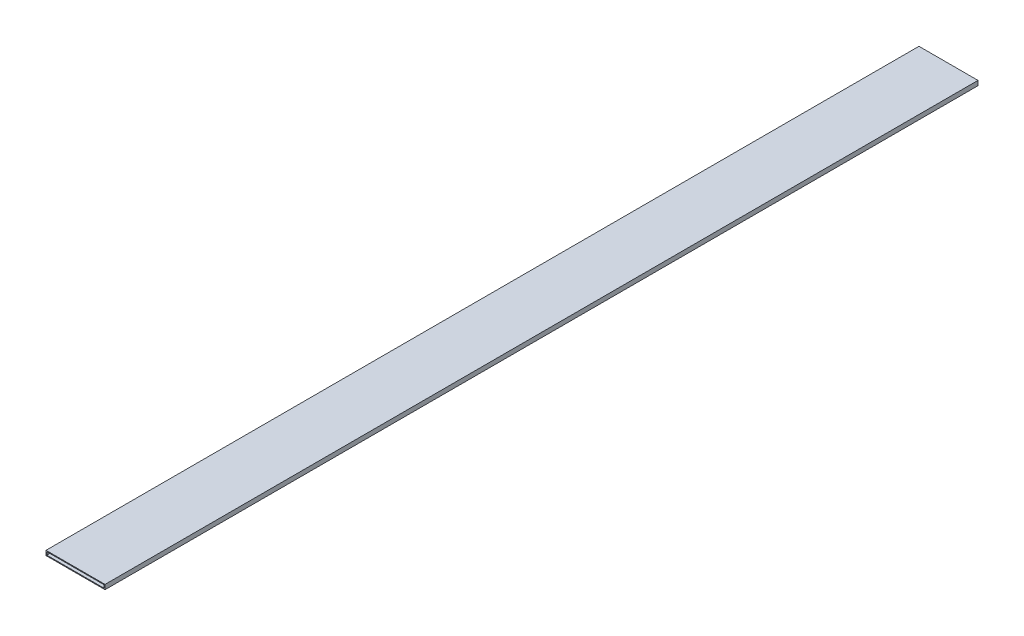
ISO-10303-21;
HEADER;
FILE_DESCRIPTION(('STEP AP214'),'2;1');
FILE_NAME('part.step','',(''),(''),'','','');
FILE_SCHEMA(('AUTOMOTIVE_DESIGN { 1 0 10303 214 1 1 1 1 }'));
ENDSEC;
DATA;
#1=APPLICATION_CONTEXT('core data for automotive mechanical design processes');
#2=APPLICATION_PROTOCOL_DEFINITION('international standard','automotive_design',2000,#1);
#3=PRODUCT_CONTEXT('',#1,'mechanical');
#4=PRODUCT('Part','Part','',(#3));
#5=PRODUCT_RELATED_PRODUCT_CATEGORY('part','',(#4));
#6=PRODUCT_DEFINITION_FORMATION('','',#4);
#7=PRODUCT_DEFINITION_CONTEXT('part definition',#1,'design');
#8=PRODUCT_DEFINITION('design','',#6,#7);
#9=PRODUCT_DEFINITION_SHAPE('','',#8);
#10=(LENGTH_UNIT() NAMED_UNIT(*) SI_UNIT(.MILLI.,.METRE.));
#11=(NAMED_UNIT(*) PLANE_ANGLE_UNIT() SI_UNIT($,.RADIAN.));
#12=(NAMED_UNIT(*) SI_UNIT($,.STERADIAN.) SOLID_ANGLE_UNIT());
#13=UNCERTAINTY_MEASURE_WITH_UNIT(LENGTH_MEASURE(1.E-05),#10,'distance_accuracy_value','');
#14=(GEOMETRIC_REPRESENTATION_CONTEXT(3) GLOBAL_UNCERTAINTY_ASSIGNED_CONTEXT((#13)) GLOBAL_UNIT_ASSIGNED_CONTEXT((#10,
#11,#12)) REPRESENTATION_CONTEXT('',''));
#15=CARTESIAN_POINT('',(0.,0.,0.));
#16=DIRECTION('',(0.,0.,1.));
#17=DIRECTION('',(1.,0.,0.));
#18=AXIS2_PLACEMENT_3D('',#15,#16,#17);
#19=CARTESIAN_POINT('',(0.,0.,340.));
#20=DIRECTION('',(0.,0.,1.));
#21=DIRECTION('',(1.,0.,0.));
#22=AXIS2_PLACEMENT_3D('',#19,#20,#21);
#23=PLANE('',#22);
#24=DIRECTION('',(0.,-1.,0.));
#25=VECTOR('',#24,1.);
#26=CARTESIAN_POINT('',(-1.63636363636363,0.585909090909091,340.));
#27=LINE('',#26,#25);
#28=CARTESIAN_POINT('',(-1.63636363636363,0.585909090909091,340.));
#29=VERTEX_POINT('',#28);
#30=CARTESIAN_POINT('',(-1.63636363636363,-1.21409090909091,340.));
#31=VERTEX_POINT('',#30);
#32=EDGE_CURVE('E134',#29,#31,#27,.T.);
#33=ORIENTED_EDGE('',*,*,#32,.T.);
#34=DIRECTION('',(1.,0.,0.));
#35=VECTOR('',#34,1.);
#36=CARTESIAN_POINT('',(-1.63636363636363,-1.21409090909091,340.));
#37=LINE('',#36,#35);
#38=CARTESIAN_POINT('',(21.3636363636364,-1.21409090909091,340.));
#39=VERTEX_POINT('',#38);
#40=EDGE_CURVE('E137',#31,#39,#37,.T.);
#41=ORIENTED_EDGE('',*,*,#40,.T.);
#42=DIRECTION('',(0.,1.,0.));
#43=VECTOR('',#42,1.);
#44=CARTESIAN_POINT('',(21.3636363636364,0.585909090909091,340.));
#45=LINE('',#44,#43);
#46=CARTESIAN_POINT('',(21.3636363636364,0.585909090909091,340.));
#47=VERTEX_POINT('',#46);
#48=EDGE_CURVE('E140',#39,#47,#45,.T.);
#49=ORIENTED_EDGE('',*,*,#48,.T.);
#50=DIRECTION('',(-1.,0.,0.));
#51=VECTOR('',#50,1.);
#52=CARTESIAN_POINT('',(-1.63636363636363,0.585909090909091,340.));
#53=LINE('',#52,#51);
#54=EDGE_CURVE('E142',#47,#29,#53,.T.);
#55=ORIENTED_EDGE('',*,*,#54,.T.);
#56=EDGE_LOOP('',(#33,#41,#49,#55));
#57=FACE_BOUND('',#56,.T.);
#58=DIRECTION('',(1.,0.,0.));
#59=VECTOR('',#58,1.);
#60=CARTESIAN_POINT('',(-1.31636363636364,-0.894090909090909,340.));
#61=LINE('',#60,#59);
#62=CARTESIAN_POINT('',(-1.31636363636364,-0.894090909090909,340.));
#63=VERTEX_POINT('',#62);
#64=CARTESIAN_POINT('',(21.0436363636364,-0.894090909090909,340.));
#65=VERTEX_POINT('',#64);
#66=EDGE_CURVE('E106',#63,#65,#61,.T.);
#67=ORIENTED_EDGE('',*,*,#66,.F.);
#68=DIRECTION('',(0.,-1.,0.));
#69=VECTOR('',#68,1.);
#70=CARTESIAN_POINT('',(-1.31636363636364,0.265909090909091,340.));
#71=LINE('',#70,#69);
#72=CARTESIAN_POINT('',(-1.31636363636364,0.265909090909091,340.));
#73=VERTEX_POINT('',#72);
#74=EDGE_CURVE('E98',#73,#63,#71,.T.);
#75=ORIENTED_EDGE('',*,*,#74,.F.);
#76=DIRECTION('',(-1.,0.,0.));
#77=VECTOR('',#76,1.);
#78=CARTESIAN_POINT('',(-1.31636363636364,0.265909090909091,340.));
#79=LINE('',#78,#77);
#80=CARTESIAN_POINT('',(21.0436363636364,0.265909090909091,340.));
#81=VERTEX_POINT('',#80);
#82=EDGE_CURVE('E120',#81,#73,#79,.T.);
#83=ORIENTED_EDGE('',*,*,#82,.F.);
#84=DIRECTION('',(0.,1.,0.));
#85=VECTOR('',#84,1.);
#86=CARTESIAN_POINT('',(21.0436363636364,0.265909090909091,340.));
#87=LINE('',#86,#85);
#88=EDGE_CURVE('E118',#65,#81,#87,.T.);
#89=ORIENTED_EDGE('',*,*,#88,.F.);
#90=EDGE_LOOP('',(#67,#75,#83,#89));
#91=FACE_BOUND('',#90,.T.);
#92=ADVANCED_FACE('F33',(#57,#91),#23,.T.);
#93=CARTESIAN_POINT('',(0.,0.,0.));
#94=DIRECTION('',(0.,0.,1.));
#95=DIRECTION('',(1.,0.,0.));
#96=AXIS2_PLACEMENT_3D('',#93,#94,#95);
#97=PLANE('',#96);
#98=DIRECTION('',(0.,-1.,0.));
#99=VECTOR('',#98,1.);
#100=CARTESIAN_POINT('',(-1.63636363636363,0.585909090909091,0.));
#101=LINE('',#100,#99);
#102=CARTESIAN_POINT('',(-1.63636363636363,0.585909090909091,0.));
#103=VERTEX_POINT('',#102);
#104=CARTESIAN_POINT('',(-1.63636363636363,-1.21409090909091,0.));
#105=VERTEX_POINT('',#104);
#106=EDGE_CURVE('E114',#103,#105,#101,.T.);
#107=ORIENTED_EDGE('',*,*,#106,.F.);
#108=DIRECTION('',(-1.,0.,0.));
#109=VECTOR('',#108,1.);
#110=CARTESIAN_POINT('',(-1.63636363636363,0.585909090909091,0.));
#111=LINE('',#110,#109);
#112=CARTESIAN_POINT('',(21.3636363636364,0.585909090909091,0.));
#113=VERTEX_POINT('',#112);
#114=EDGE_CURVE('E138',#113,#103,#111,.T.);
#115=ORIENTED_EDGE('',*,*,#114,.F.);
#116=DIRECTION('',(0.,1.,0.));
#117=VECTOR('',#116,1.);
#118=CARTESIAN_POINT('',(21.3636363636364,0.585909090909091,0.));
#119=LINE('',#118,#117);
#120=CARTESIAN_POINT('',(21.3636363636364,-1.21409090909091,0.));
#121=VERTEX_POINT('',#120);
#122=EDGE_CURVE('E149',#121,#113,#119,.T.);
#123=ORIENTED_EDGE('',*,*,#122,.F.);
#124=DIRECTION('',(1.,0.,0.));
#125=VECTOR('',#124,1.);
#126=CARTESIAN_POINT('',(-1.63636363636363,-1.21409090909091,0.));
#127=LINE('',#126,#125);
#128=EDGE_CURVE('E147',#105,#121,#127,.T.);
#129=ORIENTED_EDGE('',*,*,#128,.F.);
#130=EDGE_LOOP('',(#107,#115,#123,#129));
#131=FACE_BOUND('',#130,.T.);
#132=DIRECTION('',(0.,-1.,0.));
#133=VECTOR('',#132,1.);
#134=CARTESIAN_POINT('',(-1.31636363636364,0.265909090909091,0.));
#135=LINE('',#134,#133);
#136=CARTESIAN_POINT('',(-1.31636363636364,0.265909090909091,0.));
#137=VERTEX_POINT('',#136);
#138=CARTESIAN_POINT('',(-1.31636363636364,-0.894090909090909,0.));
#139=VERTEX_POINT('',#138);
#140=EDGE_CURVE('E56',#137,#139,#135,.T.);
#141=ORIENTED_EDGE('',*,*,#140,.T.);
#142=DIRECTION('',(1.,0.,0.));
#143=VECTOR('',#142,1.);
#144=CARTESIAN_POINT('',(-1.31636363636364,-0.894090909090909,0.));
#145=LINE('',#144,#143);
#146=CARTESIAN_POINT('',(21.0436363636364,-0.894090909090909,0.));
#147=VERTEX_POINT('',#146);
#148=EDGE_CURVE('E113',#139,#147,#145,.T.);
#149=ORIENTED_EDGE('',*,*,#148,.T.);
#150=DIRECTION('',(0.,1.,0.));
#151=VECTOR('',#150,1.);
#152=CARTESIAN_POINT('',(21.0436363636364,0.265909090909091,0.));
#153=LINE('',#152,#151);
#154=CARTESIAN_POINT('',(21.0436363636364,0.265909090909091,0.));
#155=VERTEX_POINT('',#154);
#156=EDGE_CURVE('E126',#147,#155,#153,.T.);
#157=ORIENTED_EDGE('',*,*,#156,.T.);
#158=DIRECTION('',(-1.,0.,0.));
#159=VECTOR('',#158,1.);
#160=CARTESIAN_POINT('',(-1.31636363636364,0.265909090909091,0.));
#161=LINE('',#160,#159);
#162=EDGE_CURVE('E107',#155,#137,#161,.T.);
#163=ORIENTED_EDGE('',*,*,#162,.T.);
#164=EDGE_LOOP('',(#141,#149,#157,#163));
#165=FACE_BOUND('',#164,.T.);
#166=ADVANCED_FACE('F167',(#131,#165),#97,.F.);
#167=CARTESIAN_POINT('',(-1.63636363636363,0.585909090909091,340.));
#168=DIRECTION('',(1.,0.,0.));
#169=DIRECTION('',(0.,1.,0.));
#170=AXIS2_PLACEMENT_3D('',#167,#168,#169);
#171=PLANE('',#170);
#172=ORIENTED_EDGE('',*,*,#106,.T.);
#173=DIRECTION('',(0.,0.,-1.));
#174=VECTOR('',#173,1.);
#175=CARTESIAN_POINT('',(-1.63636363636363,-1.21409090909091,340.));
#176=LINE('',#175,#174);
#177=EDGE_CURVE('E11',#31,#105,#176,.T.);
#178=ORIENTED_EDGE('',*,*,#177,.F.);
#179=ORIENTED_EDGE('',*,*,#32,.F.);
#180=DIRECTION('',(0.,0.,-1.));
#181=VECTOR('',#180,1.);
#182=CARTESIAN_POINT('',(-1.63636363636363,0.585909090909091,340.));
#183=LINE('',#182,#181);
#184=EDGE_CURVE('E144',#29,#103,#183,.T.);
#185=ORIENTED_EDGE('',*,*,#184,.T.);
#186=EDGE_LOOP('',(#172,#178,#179,#185));
#187=FACE_BOUND('',#186,.T.);
#188=ADVANCED_FACE('F35',(#187),#171,.F.);
#189=CARTESIAN_POINT('',(-1.63636363636363,-1.21409090909091,340.));
#190=DIRECTION('',(0.,1.,0.));
#191=DIRECTION('',(0.,0.,1.));
#192=AXIS2_PLACEMENT_3D('',#189,#190,#191);
#193=PLANE('',#192);
#194=ORIENTED_EDGE('',*,*,#128,.T.);
#195=DIRECTION('',(0.,0.,-1.));
#196=VECTOR('',#195,1.);
#197=CARTESIAN_POINT('',(21.3636363636364,-1.21409090909091,340.));
#198=LINE('',#197,#196);
#199=EDGE_CURVE('E41',#39,#121,#198,.T.);
#200=ORIENTED_EDGE('',*,*,#199,.F.);
#201=ORIENTED_EDGE('',*,*,#40,.F.);
#202=ORIENTED_EDGE('',*,*,#177,.T.);
#203=EDGE_LOOP('',(#194,#200,#201,#202));
#204=FACE_BOUND('',#203,.T.);
#205=ADVANCED_FACE('F177',(#204),#193,.F.);
#206=CARTESIAN_POINT('',(21.3636363636364,0.585909090909091,340.));
#207=DIRECTION('',(-1.,0.,0.));
#208=DIRECTION('',(0.,0.,1.));
#209=AXIS2_PLACEMENT_3D('',#206,#207,#208);
#210=PLANE('',#209);
#211=ORIENTED_EDGE('',*,*,#122,.T.);
#212=DIRECTION('',(0.,0.,-1.));
#213=VECTOR('',#212,1.);
#214=CARTESIAN_POINT('',(21.3636363636364,0.585909090909091,340.));
#215=LINE('',#214,#213);
#216=EDGE_CURVE('E154',#47,#113,#215,.T.);
#217=ORIENTED_EDGE('',*,*,#216,.F.);
#218=ORIENTED_EDGE('',*,*,#48,.F.);
#219=ORIENTED_EDGE('',*,*,#199,.T.);
#220=EDGE_LOOP('',(#211,#217,#218,#219));
#221=FACE_BOUND('',#220,.T.);
#222=ADVANCED_FACE('F161',(#221),#210,.F.);
#223=CARTESIAN_POINT('',(-1.63636363636363,0.585909090909091,340.));
#224=DIRECTION('',(0.,-1.,0.));
#225=DIRECTION('',(0.,0.,-1.));
#226=AXIS2_PLACEMENT_3D('',#223,#224,#225);
#227=PLANE('',#226);
#228=ORIENTED_EDGE('',*,*,#114,.T.);
#229=ORIENTED_EDGE('',*,*,#184,.F.);
#230=ORIENTED_EDGE('',*,*,#54,.F.);
#231=ORIENTED_EDGE('',*,*,#216,.T.);
#232=EDGE_LOOP('',(#228,#229,#230,#231));
#233=FACE_BOUND('',#232,.T.);
#234=ADVANCED_FACE('F171',(#233),#227,.F.);
#235=CARTESIAN_POINT('',(-1.31636363636364,0.265909090909091,340.));
#236=DIRECTION('',(1.,0.,0.));
#237=DIRECTION('',(0.,0.,-1.));
#238=AXIS2_PLACEMENT_3D('',#235,#236,#237);
#239=PLANE('',#238);
#240=ORIENTED_EDGE('',*,*,#140,.F.);
#241=DIRECTION('',(0.,0.,-1.));
#242=VECTOR('',#241,1.);
#243=CARTESIAN_POINT('',(-1.31636363636364,0.265909090909091,340.));
#244=LINE('',#243,#242);
#245=EDGE_CURVE('E102',#73,#137,#244,.T.);
#246=ORIENTED_EDGE('',*,*,#245,.F.);
#247=ORIENTED_EDGE('',*,*,#74,.T.);
#248=DIRECTION('',(0.,0.,-1.));
#249=VECTOR('',#248,1.);
#250=CARTESIAN_POINT('',(-1.31636363636364,-0.894090909090909,340.));
#251=LINE('',#250,#249);
#252=EDGE_CURVE('E101',#63,#139,#251,.T.);
#253=ORIENTED_EDGE('',*,*,#252,.T.);
#254=EDGE_LOOP('',(#240,#246,#247,#253));
#255=FACE_BOUND('',#254,.T.);
#256=ADVANCED_FACE('F100',(#255),#239,.T.);
#257=CARTESIAN_POINT('',(-1.31636363636364,-0.894090909090909,340.));
#258=DIRECTION('',(0.,1.,0.));
#259=DIRECTION('',(0.,0.,1.));
#260=AXIS2_PLACEMENT_3D('',#257,#258,#259);
#261=PLANE('',#260);
#262=ORIENTED_EDGE('',*,*,#148,.F.);
#263=ORIENTED_EDGE('',*,*,#252,.F.);
#264=ORIENTED_EDGE('',*,*,#66,.T.);
#265=DIRECTION('',(0.,0.,-1.));
#266=VECTOR('',#265,1.);
#267=CARTESIAN_POINT('',(21.0436363636364,-0.894090909090909,340.));
#268=LINE('',#267,#266);
#269=EDGE_CURVE('E115',#65,#147,#268,.T.);
#270=ORIENTED_EDGE('',*,*,#269,.T.);
#271=EDGE_LOOP('',(#262,#263,#264,#270));
#272=FACE_BOUND('',#271,.T.);
#273=ADVANCED_FACE('F110',(#272),#261,.T.);
#274=CARTESIAN_POINT('',(21.0436363636364,0.265909090909091,340.));
#275=DIRECTION('',(-1.,0.,0.));
#276=DIRECTION('',(0.,0.,1.));
#277=AXIS2_PLACEMENT_3D('',#274,#275,#276);
#278=PLANE('',#277);
#279=ORIENTED_EDGE('',*,*,#156,.F.);
#280=ORIENTED_EDGE('',*,*,#269,.F.);
#281=ORIENTED_EDGE('',*,*,#88,.T.);
#282=DIRECTION('',(0.,0.,-1.));
#283=VECTOR('',#282,1.);
#284=CARTESIAN_POINT('',(21.0436363636364,0.265909090909091,340.));
#285=LINE('',#284,#283);
#286=EDGE_CURVE('E48',#81,#155,#285,.T.);
#287=ORIENTED_EDGE('',*,*,#286,.T.);
#288=EDGE_LOOP('',(#279,#280,#281,#287));
#289=FACE_BOUND('',#288,.T.);
#290=ADVANCED_FACE('F200',(#289),#278,.T.);
#291=CARTESIAN_POINT('',(-1.31636363636364,0.265909090909091,340.));
#292=DIRECTION('',(0.,-1.,0.));
#293=DIRECTION('',(0.,0.,-1.));
#294=AXIS2_PLACEMENT_3D('',#291,#292,#293);
#295=PLANE('',#294);
#296=ORIENTED_EDGE('',*,*,#162,.F.);
#297=ORIENTED_EDGE('',*,*,#286,.F.);
#298=ORIENTED_EDGE('',*,*,#82,.T.);
#299=ORIENTED_EDGE('',*,*,#245,.T.);
#300=EDGE_LOOP('',(#296,#297,#298,#299));
#301=FACE_BOUND('',#300,.T.);
#302=ADVANCED_FACE('F204',(#301),#295,.T.);
#303=CLOSED_SHELL('',(#92,#166,#188,#205,#222,#234,#256,#273,#290,#302));
#304=MANIFOLD_SOLID_BREP('B2',#303);
#305=ADVANCED_BREP_SHAPE_REPRESENTATION('',(#18,#304),#14);
#306=SHAPE_DEFINITION_REPRESENTATION(#9,#305);
ENDSEC;
END-ISO-10303-21;
